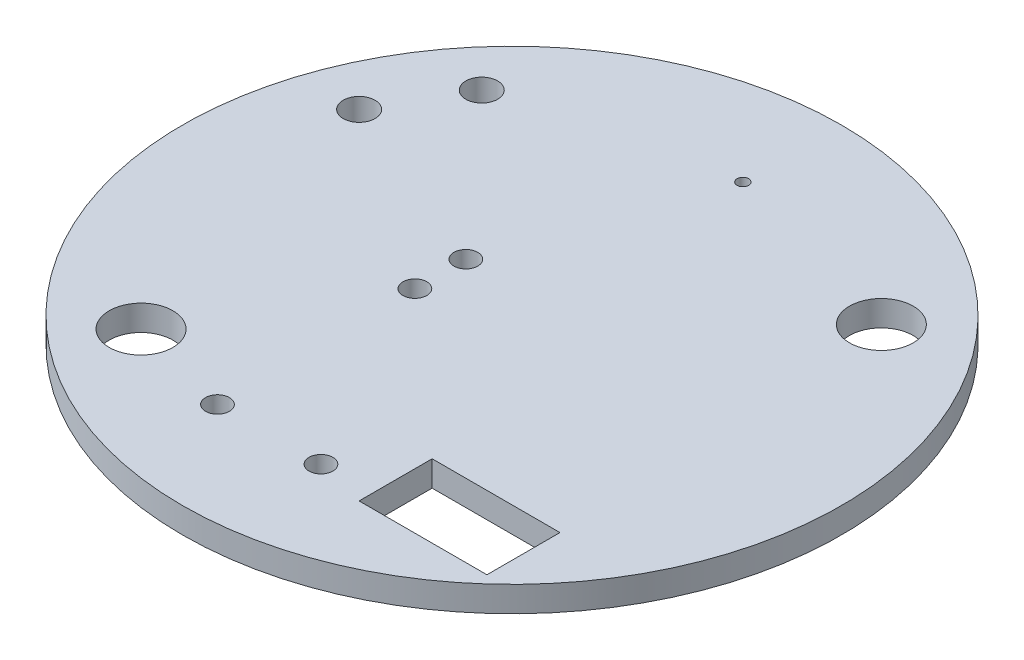
ISO-10303-21;
HEADER;
FILE_DESCRIPTION(('STEP AP214'),'2;1');
FILE_NAME('part.step','',(''),(''),'','','');
FILE_SCHEMA(('AUTOMOTIVE_DESIGN { 1 0 10303 214 1 1 1 1 }'));
ENDSEC;
DATA;
#1=APPLICATION_CONTEXT('core data for automotive mechanical design processes');
#2=APPLICATION_PROTOCOL_DEFINITION('international standard','automotive_design',2000,#1);
#3=PRODUCT_CONTEXT('',#1,'mechanical');
#4=PRODUCT('Part','Part','',(#3));
#5=PRODUCT_RELATED_PRODUCT_CATEGORY('part','',(#4));
#6=PRODUCT_DEFINITION_FORMATION('','',#4);
#7=PRODUCT_DEFINITION_CONTEXT('part definition',#1,'design');
#8=PRODUCT_DEFINITION('design','',#6,#7);
#9=PRODUCT_DEFINITION_SHAPE('','',#8);
#10=(LENGTH_UNIT() NAMED_UNIT(*) SI_UNIT(.MILLI.,.METRE.));
#11=(NAMED_UNIT(*) PLANE_ANGLE_UNIT() SI_UNIT($,.RADIAN.));
#12=(NAMED_UNIT(*) SI_UNIT($,.STERADIAN.) SOLID_ANGLE_UNIT());
#13=UNCERTAINTY_MEASURE_WITH_UNIT(LENGTH_MEASURE(1.E-05),#10,'distance_accuracy_value','');
#14=(GEOMETRIC_REPRESENTATION_CONTEXT(3) GLOBAL_UNCERTAINTY_ASSIGNED_CONTEXT((#13)) GLOBAL_UNIT_ASSIGNED_CONTEXT((#10,
#11,#12)) REPRESENTATION_CONTEXT('',''));
#15=CARTESIAN_POINT('',(0.,0.,0.));
#16=DIRECTION('',(0.,0.,1.));
#17=DIRECTION('',(1.,0.,0.));
#18=AXIS2_PLACEMENT_3D('',#15,#16,#17);
#19=CARTESIAN_POINT('',(0.,1.6,0.));
#20=DIRECTION('',(0.,1.,0.));
#21=DIRECTION('',(0.,0.,1.));
#22=AXIS2_PLACEMENT_3D('',#19,#20,#21);
#23=PLANE('',#22);
#24=CARTESIAN_POINT('',(-4.4,1.6,14.1));
#25=DIRECTION('',(0.,1.,0.));
#26=DIRECTION('',(0.,0.,1.));
#27=AXIS2_PLACEMENT_3D('',#24,#25,#26);
#28=CIRCLE('',#27,0.750000000000001);
#29=CARTESIAN_POINT('',(-4.4,1.6,14.85));
#30=VERTEX_POINT('',#29);
#31=EDGE_CURVE('E117',#30,#30,#28,.T.);
#32=ORIENTED_EDGE('',*,*,#31,.F.);
#33=EDGE_LOOP('',(#32));
#34=FACE_BOUND('',#33,.T.);
#35=CARTESIAN_POINT('',(-4.5,1.6,-1.6));
#36=DIRECTION('',(0.,1.,0.));
#37=DIRECTION('',(0.,0.,1.));
#38=AXIS2_PLACEMENT_3D('',#35,#36,#37);
#39=CIRCLE('',#38,0.75);
#40=CARTESIAN_POINT('',(-4.5,1.6,-0.850000000000002));
#41=VERTEX_POINT('',#40);
#42=EDGE_CURVE('E129',#41,#41,#39,.T.);
#43=ORIENTED_EDGE('',*,*,#42,.F.);
#44=EDGE_LOOP('',(#43));
#45=FACE_BOUND('',#44,.T.);
#46=CARTESIAN_POINT('',(-13.2,1.6,-11.3));
#47=DIRECTION('',(0.,1.,0.));
#48=DIRECTION('',(0.,0.,1.));
#49=AXIS2_PLACEMENT_3D('',#46,#47,#48);
#50=CIRCLE('',#49,1.);
#51=CARTESIAN_POINT('',(-13.2,1.6,-10.3));
#52=VERTEX_POINT('',#51);
#53=EDGE_CURVE('E141',#52,#52,#50,.T.);
#54=ORIENTED_EDGE('',*,*,#53,.F.);
#55=EDGE_LOOP('',(#54));
#56=FACE_BOUND('',#55,.T.);
#57=CARTESIAN_POINT('',(-10.9,1.6,12.4));
#58=DIRECTION('',(0.,1.,0.));
#59=DIRECTION('',(0.,0.,1.));
#60=AXIS2_PLACEMENT_3D('',#57,#58,#59);
#61=CIRCLE('',#60,2.);
#62=CARTESIAN_POINT('',(-10.9,1.6,14.4));
#63=VERTEX_POINT('',#62);
#64=EDGE_CURVE('E153',#63,#63,#61,.T.);
#65=ORIENTED_EDGE('',*,*,#64,.F.);
#66=EDGE_LOOP('',(#65));
#67=FACE_BOUND('',#66,.T.);
#68=CARTESIAN_POINT('',(0.,1.6,0.));
#69=DIRECTION('',(0.,1.,0.));
#70=DIRECTION('',(0.,0.,1.));
#71=AXIS2_PLACEMENT_3D('',#68,#69,#70);
#72=CIRCLE('',#71,20.7);
#73=CARTESIAN_POINT('',(0.,1.6,20.7));
#74=VERTEX_POINT('',#73);
#75=EDGE_CURVE('E11',#74,#74,#72,.T.);
#76=ORIENTED_EDGE('',*,*,#75,.T.);
#77=EDGE_LOOP('',(#76));
#78=FACE_BOUND('',#77,.T.);
#79=CARTESIAN_POINT('',(12.1,1.6,-11.1));
#80=DIRECTION('',(0.,1.,0.));
#81=DIRECTION('',(0.,0.,1.));
#82=AXIS2_PLACEMENT_3D('',#79,#80,#81);
#83=CIRCLE('',#82,2.);
#84=CARTESIAN_POINT('',(12.1,1.6,-9.1));
#85=VERTEX_POINT('',#84);
#86=EDGE_CURVE('E159',#85,#85,#83,.T.);
#87=ORIENTED_EDGE('',*,*,#86,.F.);
#88=EDGE_LOOP('',(#87));
#89=FACE_BOUND('',#88,.T.);
#90=CARTESIAN_POINT('',(-16.,1.6,-6.4));
#91=DIRECTION('',(0.,1.,0.));
#92=DIRECTION('',(0.,0.,1.));
#93=AXIS2_PLACEMENT_3D('',#90,#91,#92);
#94=CIRCLE('',#93,1.);
#95=CARTESIAN_POINT('',(-16.,1.6,-5.4));
#96=VERTEX_POINT('',#95);
#97=EDGE_CURVE('E147',#96,#96,#94,.T.);
#98=ORIENTED_EDGE('',*,*,#97,.F.);
#99=EDGE_LOOP('',(#98));
#100=FACE_BOUND('',#99,.T.);
#101=CARTESIAN_POINT('',(0.,1.6,-14.5));
#102=DIRECTION('',(0.,1.,0.));
#103=DIRECTION('',(0.,0.,1.));
#104=AXIS2_PLACEMENT_3D('',#101,#102,#103);
#105=CIRCLE('',#104,0.363900589046701);
#106=CARTESIAN_POINT('',(0.,1.6,-14.1360994109533));
#107=VERTEX_POINT('',#106);
#108=EDGE_CURVE('E135',#107,#107,#105,.T.);
#109=ORIENTED_EDGE('',*,*,#108,.F.);
#110=EDGE_LOOP('',(#109));
#111=FACE_BOUND('',#110,.T.);
#112=CARTESIAN_POINT('',(-4.5,1.6,1.6));
#113=DIRECTION('',(0.,1.,0.));
#114=DIRECTION('',(0.,0.,1.));
#115=AXIS2_PLACEMENT_3D('',#112,#113,#114);
#116=CIRCLE('',#115,0.75);
#117=CARTESIAN_POINT('',(-4.5,1.6,2.35));
#118=VERTEX_POINT('',#117);
#119=EDGE_CURVE('E123',#118,#118,#116,.T.);
#120=ORIENTED_EDGE('',*,*,#119,.F.);
#121=EDGE_LOOP('',(#120));
#122=FACE_BOUND('',#121,.T.);
#123=CARTESIAN_POINT('',(2.1,1.6,14.1));
#124=DIRECTION('',(0.,1.,0.));
#125=DIRECTION('',(0.,0.,1.));
#126=AXIS2_PLACEMENT_3D('',#123,#124,#125);
#127=CIRCLE('',#126,0.75);
#128=CARTESIAN_POINT('',(2.1,1.6,14.85));
#129=VERTEX_POINT('',#128);
#130=EDGE_CURVE('E111',#129,#129,#127,.T.);
#131=ORIENTED_EDGE('',*,*,#130,.F.);
#132=EDGE_LOOP('',(#131));
#133=FACE_BOUND('',#132,.T.);
#134=DIRECTION('',(0.,0.,1.));
#135=VECTOR('',#134,1.);
#136=CARTESIAN_POINT('',(5.29558144002762,1.6,14.9005090360504));
#137=LINE('',#136,#135);
#138=CARTESIAN_POINT('',(5.29558144002762,1.6,10.3117608228729));
#139=VERTEX_POINT('',#138);
#140=CARTESIAN_POINT('',(5.29558144002762,1.6,14.9005090360504));
#141=VERTEX_POINT('',#140);
#142=EDGE_CURVE('E83',#139,#141,#137,.T.);
#143=ORIENTED_EDGE('',*,*,#142,.F.);
#144=DIRECTION('',(-1.,0.,0.));
#145=VECTOR('',#144,1.);
#146=CARTESIAN_POINT('',(5.29558144002762,1.6,10.3117608228729));
#147=LINE('',#146,#145);
#148=CARTESIAN_POINT('',(13.3258908130881,1.6,10.3117608228729));
#149=VERTEX_POINT('',#148);
#150=EDGE_CURVE('E75',#149,#139,#147,.T.);
#151=ORIENTED_EDGE('',*,*,#150,.F.);
#152=DIRECTION('',(0.,0.,-1.));
#153=VECTOR('',#152,1.);
#154=CARTESIAN_POINT('',(13.3258908130881,1.6,14.9005090360504));
#155=LINE('',#154,#153);
#156=CARTESIAN_POINT('',(13.3258908130881,1.6,14.9005090360504));
#157=VERTEX_POINT('',#156);
#158=EDGE_CURVE('E97',#157,#149,#155,.T.);
#159=ORIENTED_EDGE('',*,*,#158,.F.);
#160=DIRECTION('',(1.,0.,0.));
#161=VECTOR('',#160,1.);
#162=CARTESIAN_POINT('',(5.29558144002762,1.6,14.9005090360504));
#163=LINE('',#162,#161);
#164=EDGE_CURVE('E95',#141,#157,#163,.T.);
#165=ORIENTED_EDGE('',*,*,#164,.F.);
#166=EDGE_LOOP('',(#143,#151,#159,#165));
#167=FACE_BOUND('',#166,.T.);
#168=ADVANCED_FACE('F34',(#34,#45,#56,#67,#78,#89,#100,#111,#122,#133,#167),#23,.T.);
#169=CARTESIAN_POINT('',(0.,0.,0.));
#170=DIRECTION('',(0.,1.,0.));
#171=DIRECTION('',(0.,0.,1.));
#172=AXIS2_PLACEMENT_3D('',#169,#170,#171);
#173=PLANE('',#172);
#174=CARTESIAN_POINT('',(2.1,0.,14.1));
#175=DIRECTION('',(0.,1.,0.));
#176=DIRECTION('',(0.,0.,1.));
#177=AXIS2_PLACEMENT_3D('',#174,#175,#176);
#178=CIRCLE('',#177,0.75);
#179=CARTESIAN_POINT('',(2.1,0.,14.85));
#180=VERTEX_POINT('',#179);
#181=EDGE_CURVE('E91',#180,#180,#178,.T.);
#182=ORIENTED_EDGE('',*,*,#181,.T.);
#183=EDGE_LOOP('',(#182));
#184=FACE_BOUND('',#183,.T.);
#185=CARTESIAN_POINT('',(-4.4,0.,14.1));
#186=DIRECTION('',(0.,1.,0.));
#187=DIRECTION('',(0.,0.,1.));
#188=AXIS2_PLACEMENT_3D('',#185,#186,#187);
#189=CIRCLE('',#188,0.750000000000001);
#190=CARTESIAN_POINT('',(-4.4,0.,14.85));
#191=VERTEX_POINT('',#190);
#192=EDGE_CURVE('E114',#191,#191,#189,.T.);
#193=ORIENTED_EDGE('',*,*,#192,.T.);
#194=EDGE_LOOP('',(#193));
#195=FACE_BOUND('',#194,.T.);
#196=CARTESIAN_POINT('',(-4.5,0.,1.6));
#197=DIRECTION('',(0.,1.,0.));
#198=DIRECTION('',(0.,0.,1.));
#199=AXIS2_PLACEMENT_3D('',#196,#197,#198);
#200=CIRCLE('',#199,0.75);
#201=CARTESIAN_POINT('',(-4.5,0.,2.35));
#202=VERTEX_POINT('',#201);
#203=EDGE_CURVE('E120',#202,#202,#200,.T.);
#204=ORIENTED_EDGE('',*,*,#203,.T.);
#205=EDGE_LOOP('',(#204));
#206=FACE_BOUND('',#205,.T.);
#207=CARTESIAN_POINT('',(-4.5,0.,-1.6));
#208=DIRECTION('',(0.,1.,0.));
#209=DIRECTION('',(0.,0.,1.));
#210=AXIS2_PLACEMENT_3D('',#207,#208,#209);
#211=CIRCLE('',#210,0.75);
#212=CARTESIAN_POINT('',(-4.5,0.,-0.850000000000002));
#213=VERTEX_POINT('',#212);
#214=EDGE_CURVE('E126',#213,#213,#211,.T.);
#215=ORIENTED_EDGE('',*,*,#214,.T.);
#216=EDGE_LOOP('',(#215));
#217=FACE_BOUND('',#216,.T.);
#218=CARTESIAN_POINT('',(0.,0.,-14.5));
#219=DIRECTION('',(0.,1.,0.));
#220=DIRECTION('',(0.,0.,1.));
#221=AXIS2_PLACEMENT_3D('',#218,#219,#220);
#222=CIRCLE('',#221,0.363900589046701);
#223=CARTESIAN_POINT('',(0.,0.,-14.1360994109533));
#224=VERTEX_POINT('',#223);
#225=EDGE_CURVE('E132',#224,#224,#222,.T.);
#226=ORIENTED_EDGE('',*,*,#225,.T.);
#227=EDGE_LOOP('',(#226));
#228=FACE_BOUND('',#227,.T.);
#229=CARTESIAN_POINT('',(-13.2,0.,-11.3));
#230=DIRECTION('',(0.,1.,0.));
#231=DIRECTION('',(0.,0.,1.));
#232=AXIS2_PLACEMENT_3D('',#229,#230,#231);
#233=CIRCLE('',#232,1.);
#234=CARTESIAN_POINT('',(-13.2,0.,-10.3));
#235=VERTEX_POINT('',#234);
#236=EDGE_CURVE('E138',#235,#235,#233,.T.);
#237=ORIENTED_EDGE('',*,*,#236,.T.);
#238=EDGE_LOOP('',(#237));
#239=FACE_BOUND('',#238,.T.);
#240=CARTESIAN_POINT('',(-16.,0.,-6.4));
#241=DIRECTION('',(0.,1.,0.));
#242=DIRECTION('',(0.,0.,1.));
#243=AXIS2_PLACEMENT_3D('',#240,#241,#242);
#244=CIRCLE('',#243,1.);
#245=CARTESIAN_POINT('',(-16.,0.,-5.4));
#246=VERTEX_POINT('',#245);
#247=EDGE_CURVE('E144',#246,#246,#244,.T.);
#248=ORIENTED_EDGE('',*,*,#247,.T.);
#249=EDGE_LOOP('',(#248));
#250=FACE_BOUND('',#249,.T.);
#251=CARTESIAN_POINT('',(-10.9,0.,12.4));
#252=DIRECTION('',(0.,1.,0.));
#253=DIRECTION('',(0.,0.,1.));
#254=AXIS2_PLACEMENT_3D('',#251,#252,#253);
#255=CIRCLE('',#254,2.);
#256=CARTESIAN_POINT('',(-10.9,0.,14.4));
#257=VERTEX_POINT('',#256);
#258=EDGE_CURVE('E150',#257,#257,#255,.T.);
#259=ORIENTED_EDGE('',*,*,#258,.T.);
#260=EDGE_LOOP('',(#259));
#261=FACE_BOUND('',#260,.T.);
#262=CARTESIAN_POINT('',(12.1,0.,-11.1));
#263=DIRECTION('',(0.,1.,0.));
#264=DIRECTION('',(0.,0.,1.));
#265=AXIS2_PLACEMENT_3D('',#262,#263,#264);
#266=CIRCLE('',#265,2.);
#267=CARTESIAN_POINT('',(12.1,0.,-9.1));
#268=VERTEX_POINT('',#267);
#269=EDGE_CURVE('E156',#268,#268,#266,.T.);
#270=ORIENTED_EDGE('',*,*,#269,.T.);
#271=EDGE_LOOP('',(#270));
#272=FACE_BOUND('',#271,.T.);
#273=CARTESIAN_POINT('',(0.,0.,0.));
#274=DIRECTION('',(0.,1.,0.));
#275=DIRECTION('',(0.,0.,1.));
#276=AXIS2_PLACEMENT_3D('',#273,#274,#275);
#277=CIRCLE('',#276,20.7);
#278=CARTESIAN_POINT('',(0.,0.,20.7));
#279=VERTEX_POINT('',#278);
#280=EDGE_CURVE('E38',#279,#279,#277,.T.);
#281=ORIENTED_EDGE('',*,*,#280,.F.);
#282=EDGE_LOOP('',(#281));
#283=FACE_BOUND('',#282,.T.);
#284=DIRECTION('',(-1.,0.,0.));
#285=VECTOR('',#284,1.);
#286=CARTESIAN_POINT('',(5.29558144002762,0.,10.3117608228729));
#287=LINE('',#286,#285);
#288=CARTESIAN_POINT('',(13.3258908130881,0.,10.3117608228729));
#289=VERTEX_POINT('',#288);
#290=CARTESIAN_POINT('',(5.29558144002762,0.,10.3117608228729));
#291=VERTEX_POINT('',#290);
#292=EDGE_CURVE('E57',#289,#291,#287,.T.);
#293=ORIENTED_EDGE('',*,*,#292,.T.);
#294=DIRECTION('',(0.,0.,1.));
#295=VECTOR('',#294,1.);
#296=CARTESIAN_POINT('',(5.29558144002762,0.,14.9005090360504));
#297=LINE('',#296,#295);
#298=CARTESIAN_POINT('',(5.29558144002762,0.,14.9005090360504));
#299=VERTEX_POINT('',#298);
#300=EDGE_CURVE('E90',#291,#299,#297,.T.);
#301=ORIENTED_EDGE('',*,*,#300,.T.);
#302=DIRECTION('',(1.,0.,0.));
#303=VECTOR('',#302,1.);
#304=CARTESIAN_POINT('',(5.29558144002762,0.,14.9005090360504));
#305=LINE('',#304,#303);
#306=CARTESIAN_POINT('',(13.3258908130881,0.,14.9005090360504));
#307=VERTEX_POINT('',#306);
#308=EDGE_CURVE('E103',#299,#307,#305,.T.);
#309=ORIENTED_EDGE('',*,*,#308,.T.);
#310=DIRECTION('',(0.,0.,-1.));
#311=VECTOR('',#310,1.);
#312=CARTESIAN_POINT('',(13.3258908130881,0.,14.9005090360504));
#313=LINE('',#312,#311);
#314=EDGE_CURVE('E84',#307,#289,#313,.T.);
#315=ORIENTED_EDGE('',*,*,#314,.T.);
#316=EDGE_LOOP('',(#293,#301,#309,#315));
#317=FACE_BOUND('',#316,.T.);
#318=ADVANCED_FACE('F165',(#184,#195,#206,#217,#228,#239,#250,#261,#272,#283,#317),#173,.F.);
#319=CARTESIAN_POINT('',(0.,1.6,0.));
#320=DIRECTION('',(0.,-1.,0.));
#321=DIRECTION('',(0.,0.,-1.));
#322=AXIS2_PLACEMENT_3D('',#319,#320,#321);
#323=CYLINDRICAL_SURFACE('',#322,20.7);
#324=ORIENTED_EDGE('',*,*,#75,.F.);
#325=EDGE_LOOP('',(#324));
#326=FACE_BOUND('',#325,.T.);
#327=ORIENTED_EDGE('',*,*,#280,.T.);
#328=EDGE_LOOP('',(#327));
#329=FACE_BOUND('',#328,.T.);
#330=ADVANCED_FACE('F36',(#326,#329),#323,.T.);
#331=CARTESIAN_POINT('',(12.1,1.6,-11.1));
#332=DIRECTION('',(0.,-1.,0.));
#333=DIRECTION('',(0.,0.,-1.));
#334=AXIS2_PLACEMENT_3D('',#331,#332,#333);
#335=CYLINDRICAL_SURFACE('',#334,2.);
#336=ORIENTED_EDGE('',*,*,#86,.T.);
#337=EDGE_LOOP('',(#336));
#338=FACE_BOUND('',#337,.T.);
#339=ORIENTED_EDGE('',*,*,#269,.F.);
#340=EDGE_LOOP('',(#339));
#341=FACE_BOUND('',#340,.T.);
#342=ADVANCED_FACE('F168',(#338,#341),#335,.F.);
#343=CARTESIAN_POINT('',(-10.9,1.6,12.4));
#344=DIRECTION('',(0.,-1.,0.));
#345=DIRECTION('',(0.,0.,-1.));
#346=AXIS2_PLACEMENT_3D('',#343,#344,#345);
#347=CYLINDRICAL_SURFACE('',#346,2.);
#348=ORIENTED_EDGE('',*,*,#64,.T.);
#349=EDGE_LOOP('',(#348));
#350=FACE_BOUND('',#349,.T.);
#351=ORIENTED_EDGE('',*,*,#258,.F.);
#352=EDGE_LOOP('',(#351));
#353=FACE_BOUND('',#352,.T.);
#354=ADVANCED_FACE('F170',(#350,#353),#347,.F.);
#355=CARTESIAN_POINT('',(-16.,1.6,-6.4));
#356=DIRECTION('',(0.,-1.,0.));
#357=DIRECTION('',(0.,0.,-1.));
#358=AXIS2_PLACEMENT_3D('',#355,#356,#357);
#359=CYLINDRICAL_SURFACE('',#358,1.);
#360=ORIENTED_EDGE('',*,*,#97,.T.);
#361=EDGE_LOOP('',(#360));
#362=FACE_BOUND('',#361,.T.);
#363=ORIENTED_EDGE('',*,*,#247,.F.);
#364=EDGE_LOOP('',(#363));
#365=FACE_BOUND('',#364,.T.);
#366=ADVANCED_FACE('F177',(#362,#365),#359,.F.);
#367=CARTESIAN_POINT('',(-13.2,1.6,-11.3));
#368=DIRECTION('',(0.,-1.,0.));
#369=DIRECTION('',(0.,0.,-1.));
#370=AXIS2_PLACEMENT_3D('',#367,#368,#369);
#371=CYLINDRICAL_SURFACE('',#370,1.);
#372=ORIENTED_EDGE('',*,*,#53,.T.);
#373=EDGE_LOOP('',(#372));
#374=FACE_BOUND('',#373,.T.);
#375=ORIENTED_EDGE('',*,*,#236,.F.);
#376=EDGE_LOOP('',(#375));
#377=FACE_BOUND('',#376,.T.);
#378=ADVANCED_FACE('F231',(#374,#377),#371,.F.);
#379=CARTESIAN_POINT('',(0.,1.6,-14.5));
#380=DIRECTION('',(0.,-1.,0.));
#381=DIRECTION('',(0.,0.,-1.));
#382=AXIS2_PLACEMENT_3D('',#379,#380,#381);
#383=CYLINDRICAL_SURFACE('',#382,0.363900589046701);
#384=ORIENTED_EDGE('',*,*,#108,.T.);
#385=EDGE_LOOP('',(#384));
#386=FACE_BOUND('',#385,.T.);
#387=ORIENTED_EDGE('',*,*,#225,.F.);
#388=EDGE_LOOP('',(#387));
#389=FACE_BOUND('',#388,.T.);
#390=ADVANCED_FACE('F237',(#386,#389),#383,.F.);
#391=CARTESIAN_POINT('',(-4.5,1.6,-1.6));
#392=DIRECTION('',(0.,-1.,0.));
#393=DIRECTION('',(0.,0.,-1.));
#394=AXIS2_PLACEMENT_3D('',#391,#392,#393);
#395=CYLINDRICAL_SURFACE('',#394,0.75);
#396=ORIENTED_EDGE('',*,*,#42,.T.);
#397=EDGE_LOOP('',(#396));
#398=FACE_BOUND('',#397,.T.);
#399=ORIENTED_EDGE('',*,*,#214,.F.);
#400=EDGE_LOOP('',(#399));
#401=FACE_BOUND('',#400,.T.);
#402=ADVANCED_FACE('F243',(#398,#401),#395,.F.);
#403=CARTESIAN_POINT('',(-4.5,1.6,1.6));
#404=DIRECTION('',(0.,-1.,0.));
#405=DIRECTION('',(0.,0.,-1.));
#406=AXIS2_PLACEMENT_3D('',#403,#404,#405);
#407=CYLINDRICAL_SURFACE('',#406,0.75);
#408=ORIENTED_EDGE('',*,*,#119,.T.);
#409=EDGE_LOOP('',(#408));
#410=FACE_BOUND('',#409,.T.);
#411=ORIENTED_EDGE('',*,*,#203,.F.);
#412=EDGE_LOOP('',(#411));
#413=FACE_BOUND('',#412,.T.);
#414=ADVANCED_FACE('F247',(#410,#413),#407,.F.);
#415=CARTESIAN_POINT('',(-4.4,1.6,14.1));
#416=DIRECTION('',(0.,-1.,0.));
#417=DIRECTION('',(0.,0.,-1.));
#418=AXIS2_PLACEMENT_3D('',#415,#416,#417);
#419=CYLINDRICAL_SURFACE('',#418,0.750000000000001);
#420=ORIENTED_EDGE('',*,*,#31,.T.);
#421=EDGE_LOOP('',(#420));
#422=FACE_BOUND('',#421,.T.);
#423=ORIENTED_EDGE('',*,*,#192,.F.);
#424=EDGE_LOOP('',(#423));
#425=FACE_BOUND('',#424,.T.);
#426=ADVANCED_FACE('F211',(#422,#425),#419,.F.);
#427=CARTESIAN_POINT('',(2.1,1.6,14.1));
#428=DIRECTION('',(0.,-1.,0.));
#429=DIRECTION('',(0.,0.,-1.));
#430=AXIS2_PLACEMENT_3D('',#427,#428,#429);
#431=CYLINDRICAL_SURFACE('',#430,0.75);
#432=ORIENTED_EDGE('',*,*,#130,.T.);
#433=EDGE_LOOP('',(#432));
#434=FACE_BOUND('',#433,.T.);
#435=ORIENTED_EDGE('',*,*,#181,.F.);
#436=EDGE_LOOP('',(#435));
#437=FACE_BOUND('',#436,.T.);
#438=ADVANCED_FACE('F208',(#434,#437),#431,.F.);
#439=CARTESIAN_POINT('',(5.29558144002762,1.6,10.3117608228729));
#440=DIRECTION('',(0.,0.,1.));
#441=DIRECTION('',(1.,0.,0.));
#442=AXIS2_PLACEMENT_3D('',#439,#440,#441);
#443=PLANE('',#442);
#444=ORIENTED_EDGE('',*,*,#292,.F.);
#445=DIRECTION('',(0.,-1.,0.));
#446=VECTOR('',#445,1.);
#447=CARTESIAN_POINT('',(13.3258908130881,1.6,10.3117608228729));
#448=LINE('',#447,#446);
#449=EDGE_CURVE('E79',#149,#289,#448,.T.);
#450=ORIENTED_EDGE('',*,*,#449,.F.);
#451=ORIENTED_EDGE('',*,*,#150,.T.);
#452=DIRECTION('',(0.,-1.,0.));
#453=VECTOR('',#452,1.);
#454=CARTESIAN_POINT('',(5.29558144002762,1.6,10.3117608228729));
#455=LINE('',#454,#453);
#456=EDGE_CURVE('E78',#139,#291,#455,.T.);
#457=ORIENTED_EDGE('',*,*,#456,.T.);
#458=EDGE_LOOP('',(#444,#450,#451,#457));
#459=FACE_BOUND('',#458,.T.);
#460=ADVANCED_FACE('F77',(#459),#443,.T.);
#461=CARTESIAN_POINT('',(5.29558144002762,1.6,14.9005090360504));
#462=DIRECTION('',(1.,0.,0.));
#463=DIRECTION('',(0.,0.,-1.));
#464=AXIS2_PLACEMENT_3D('',#461,#462,#463);
#465=PLANE('',#464);
#466=ORIENTED_EDGE('',*,*,#300,.F.);
#467=ORIENTED_EDGE('',*,*,#456,.F.);
#468=ORIENTED_EDGE('',*,*,#142,.T.);
#469=DIRECTION('',(0.,-1.,0.));
#470=VECTOR('',#469,1.);
#471=CARTESIAN_POINT('',(5.29558144002762,1.6,14.9005090360504));
#472=LINE('',#471,#470);
#473=EDGE_CURVE('E92',#141,#299,#472,.T.);
#474=ORIENTED_EDGE('',*,*,#473,.T.);
#475=EDGE_LOOP('',(#466,#467,#468,#474));
#476=FACE_BOUND('',#475,.T.);
#477=ADVANCED_FACE('F87',(#476),#465,.T.);
#478=CARTESIAN_POINT('',(5.29558144002762,1.6,14.9005090360504));
#479=DIRECTION('',(0.,0.,-1.));
#480=DIRECTION('',(-1.,0.,0.));
#481=AXIS2_PLACEMENT_3D('',#478,#479,#480);
#482=PLANE('',#481);
#483=ORIENTED_EDGE('',*,*,#308,.F.);
#484=ORIENTED_EDGE('',*,*,#473,.F.);
#485=ORIENTED_EDGE('',*,*,#164,.T.);
#486=DIRECTION('',(0.,-1.,0.));
#487=VECTOR('',#486,1.);
#488=CARTESIAN_POINT('',(13.3258908130881,1.6,14.9005090360504));
#489=LINE('',#488,#487);
#490=EDGE_CURVE('E49',#157,#307,#489,.T.);
#491=ORIENTED_EDGE('',*,*,#490,.T.);
#492=EDGE_LOOP('',(#483,#484,#485,#491));
#493=FACE_BOUND('',#492,.T.);
#494=ADVANCED_FACE('F259',(#493),#482,.T.);
#495=CARTESIAN_POINT('',(13.3258908130881,1.6,14.9005090360504));
#496=DIRECTION('',(-1.,0.,0.));
#497=DIRECTION('',(0.,0.,1.));
#498=AXIS2_PLACEMENT_3D('',#495,#496,#497);
#499=PLANE('',#498);
#500=ORIENTED_EDGE('',*,*,#314,.F.);
#501=ORIENTED_EDGE('',*,*,#490,.F.);
#502=ORIENTED_EDGE('',*,*,#158,.T.);
#503=ORIENTED_EDGE('',*,*,#449,.T.);
#504=EDGE_LOOP('',(#500,#501,#502,#503));
#505=FACE_BOUND('',#504,.T.);
#506=ADVANCED_FACE('F262',(#505),#499,.T.);
#507=CLOSED_SHELL('',(#168,#318,#330,#342,#354,#366,#378,#390,#402,#414,#426,#438,#460,#477,
#494,#506));
#508=MANIFOLD_SOLID_BREP('B2',#507);
#509=ADVANCED_BREP_SHAPE_REPRESENTATION('',(#18,#508),#14);
#510=SHAPE_DEFINITION_REPRESENTATION(#9,#509);
ENDSEC;
END-ISO-10303-21;
